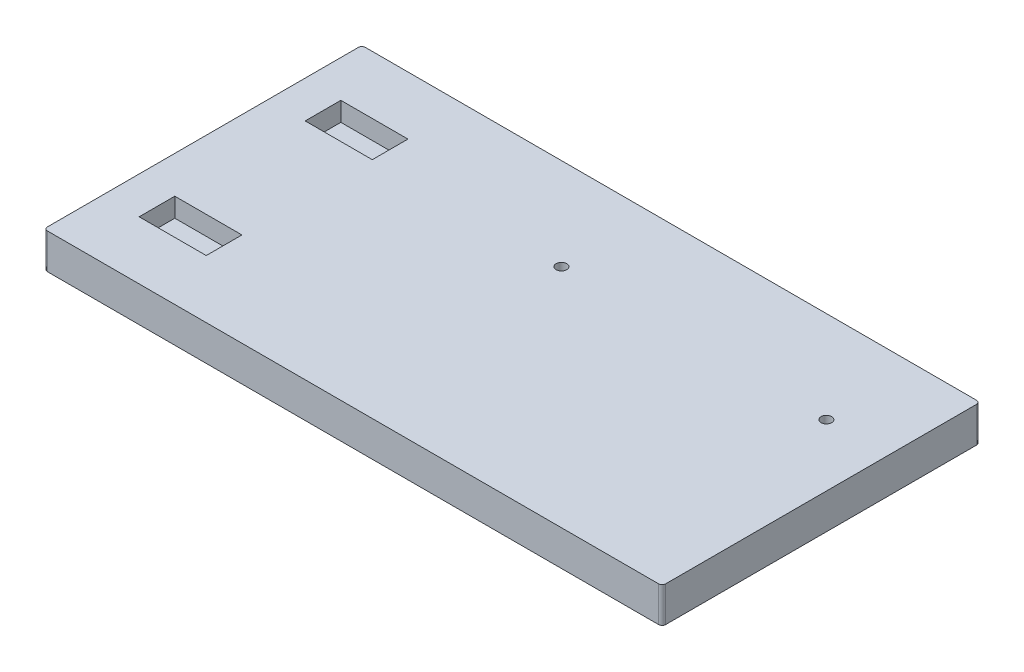
ISO-10303-21;
HEADER;
FILE_DESCRIPTION(('STEP AP214'),'2;1');
FILE_NAME('part.step','',(''),(''),'','','');
FILE_SCHEMA(('AUTOMOTIVE_DESIGN { 1 0 10303 214 1 1 1 1 }'));
ENDSEC;
DATA;
#1=APPLICATION_CONTEXT('core data for automotive mechanical design processes');
#2=APPLICATION_PROTOCOL_DEFINITION('international standard','automotive_design',2000,#1);
#3=PRODUCT_CONTEXT('',#1,'mechanical');
#4=PRODUCT('Part','Part','',(#3));
#5=PRODUCT_RELATED_PRODUCT_CATEGORY('part','',(#4));
#6=PRODUCT_DEFINITION_FORMATION('','',#4);
#7=PRODUCT_DEFINITION_CONTEXT('part definition',#1,'design');
#8=PRODUCT_DEFINITION('design','',#6,#7);
#9=PRODUCT_DEFINITION_SHAPE('','',#8);
#10=(LENGTH_UNIT() NAMED_UNIT(*) SI_UNIT(.MILLI.,.METRE.));
#11=(NAMED_UNIT(*) PLANE_ANGLE_UNIT() SI_UNIT($,.RADIAN.));
#12=(NAMED_UNIT(*) SI_UNIT($,.STERADIAN.) SOLID_ANGLE_UNIT());
#13=UNCERTAINTY_MEASURE_WITH_UNIT(LENGTH_MEASURE(1.E-05),#10,'distance_accuracy_value','');
#14=(GEOMETRIC_REPRESENTATION_CONTEXT(3) GLOBAL_UNCERTAINTY_ASSIGNED_CONTEXT((#13)) GLOBAL_UNIT_ASSIGNED_CONTEXT((#10,
#11,#12)) REPRESENTATION_CONTEXT('',''));
#15=CARTESIAN_POINT('',(0.,0.,0.));
#16=DIRECTION('',(0.,0.,1.));
#17=DIRECTION('',(1.,0.,0.));
#18=AXIS2_PLACEMENT_3D('',#15,#16,#17);
#19=CARTESIAN_POINT('',(0.,10.,0.));
#20=DIRECTION('',(0.,1.,0.));
#21=DIRECTION('',(0.,0.,1.));
#22=AXIS2_PLACEMENT_3D('',#19,#20,#21);
#23=PLANE('',#22);
#24=CARTESIAN_POINT('',(-4.99999999999998,10.,-19.));
#25=DIRECTION('',(0.,1.,0.));
#26=DIRECTION('',(0.,0.,1.));
#27=AXIS2_PLACEMENT_3D('',#24,#25,#26);
#28=CIRCLE('',#27,1.5);
#29=CARTESIAN_POINT('',(-4.99999999999998,10.,-17.5));
#30=VERTEX_POINT('',#29);
#31=EDGE_CURVE('E531',#30,#30,#28,.T.);
#32=ORIENTED_EDGE('',*,*,#31,.F.);
#33=EDGE_LOOP('',(#32));
#34=FACE_BOUND('',#33,.T.);
#35=CARTESIAN_POINT('',(70.,10.,-19.));
#36=DIRECTION('',(0.,1.,0.));
#37=DIRECTION('',(0.,0.,1.));
#38=AXIS2_PLACEMENT_3D('',#35,#36,#37);
#39=CIRCLE('',#38,1.5);
#40=CARTESIAN_POINT('',(70.,10.,-17.5));
#41=VERTEX_POINT('',#40);
#42=EDGE_CURVE('E530',#41,#41,#39,.T.);
#43=ORIENTED_EDGE('',*,*,#42,.F.);
#44=EDGE_LOOP('',(#43));
#45=FACE_BOUND('',#44,.T.);
#46=DIRECTION('',(1.,0.,0.));
#47=VECTOR('',#46,1.);
#48=CARTESIAN_POINT('',(0.,10.,28.55));
#49=LINE('',#48,#47);
#50=CARTESIAN_POINT('',(-77.,10.,28.55));
#51=VERTEX_POINT('',#50);
#52=CARTESIAN_POINT('',(-58.,10.,28.55));
#53=VERTEX_POINT('',#52);
#54=EDGE_CURVE('E198',#51,#53,#49,.T.);
#55=ORIENTED_EDGE('',*,*,#54,.F.);
#56=DIRECTION('',(0.,0.,-1.));
#57=VECTOR('',#56,1.);
#58=CARTESIAN_POINT('',(-77.,10.,0.));
#59=LINE('',#58,#57);
#60=CARTESIAN_POINT('',(-77.,10.,18.45));
#61=VERTEX_POINT('',#60);
#62=EDGE_CURVE('E206',#51,#61,#59,.T.);
#63=ORIENTED_EDGE('',*,*,#62,.T.);
#64=DIRECTION('',(1.,0.,0.));
#65=VECTOR('',#64,1.);
#66=CARTESIAN_POINT('',(0.,10.,18.45));
#67=LINE('',#66,#65);
#68=CARTESIAN_POINT('',(-58.,10.,18.45));
#69=VERTEX_POINT('',#68);
#70=EDGE_CURVE('E218',#61,#69,#67,.T.);
#71=ORIENTED_EDGE('',*,*,#70,.T.);
#72=DIRECTION('',(0.,0.,-1.));
#73=VECTOR('',#72,1.);
#74=CARTESIAN_POINT('',(-58.,10.,0.));
#75=LINE('',#74,#73);
#76=EDGE_CURVE('E215',#53,#69,#75,.T.);
#77=ORIENTED_EDGE('',*,*,#76,.F.);
#78=EDGE_LOOP('',(#55,#63,#71,#77));
#79=FACE_BOUND('',#78,.T.);
#80=DIRECTION('',(-1.,0.,0.));
#81=VECTOR('',#80,1.);
#82=CARTESIAN_POINT('',(87.5,10.,-45.));
#83=LINE('',#82,#81);
#84=CARTESIAN_POINT('',(86.5,10.,-45.));
#85=VERTEX_POINT('',#84);
#86=CARTESIAN_POINT('',(-86.5,10.,-45.));
#87=VERTEX_POINT('',#86);
#88=EDGE_CURVE('E240',#85,#87,#83,.T.);
#89=ORIENTED_EDGE('',*,*,#88,.T.);
#90=CARTESIAN_POINT('',(-86.5,10.,-44.));
#91=DIRECTION('',(0.,1.,0.));
#92=DIRECTION('',(0.,0.,1.));
#93=AXIS2_PLACEMENT_3D('',#90,#91,#92);
#94=CIRCLE('',#93,1.);
#95=CARTESIAN_POINT('',(-87.5,10.,-44.));
#96=VERTEX_POINT('',#95);
#97=EDGE_CURVE('E275',#87,#96,#94,.T.);
#98=ORIENTED_EDGE('',*,*,#97,.T.);
#99=DIRECTION('',(0.,0.,1.));
#100=VECTOR('',#99,1.);
#101=CARTESIAN_POINT('',(-87.5,10.,45.));
#102=LINE('',#101,#100);
#103=CARTESIAN_POINT('',(-87.5,10.,44.));
#104=VERTEX_POINT('',#103);
#105=EDGE_CURVE('E232',#96,#104,#102,.T.);
#106=ORIENTED_EDGE('',*,*,#105,.T.);
#107=CARTESIAN_POINT('',(-86.5,10.,44.));
#108=DIRECTION('',(0.,1.,0.));
#109=DIRECTION('',(0.,0.,1.));
#110=AXIS2_PLACEMENT_3D('',#107,#108,#109);
#111=CIRCLE('',#110,1.);
#112=CARTESIAN_POINT('',(-86.5,10.,45.));
#113=VERTEX_POINT('',#112);
#114=EDGE_CURVE('E270',#104,#113,#111,.T.);
#115=ORIENTED_EDGE('',*,*,#114,.T.);
#116=DIRECTION('',(1.,0.,0.));
#117=VECTOR('',#116,1.);
#118=CARTESIAN_POINT('',(87.5,10.,45.));
#119=LINE('',#118,#117);
#120=CARTESIAN_POINT('',(86.5,10.,45.));
#121=VERTEX_POINT('',#120);
#122=EDGE_CURVE('E235',#113,#121,#119,.T.);
#123=ORIENTED_EDGE('',*,*,#122,.T.);
#124=CARTESIAN_POINT('',(86.5,10.,44.));
#125=DIRECTION('',(0.,1.,0.));
#126=DIRECTION('',(0.,0.,1.));
#127=AXIS2_PLACEMENT_3D('',#124,#125,#126);
#128=CIRCLE('',#127,1.);
#129=CARTESIAN_POINT('',(87.5,10.,44.));
#130=VERTEX_POINT('',#129);
#131=EDGE_CURVE('E65',#121,#130,#128,.T.);
#132=ORIENTED_EDGE('',*,*,#131,.T.);
#133=DIRECTION('',(0.,0.,-1.));
#134=VECTOR('',#133,1.);
#135=CARTESIAN_POINT('',(87.5,10.,45.));
#136=LINE('',#135,#134);
#137=CARTESIAN_POINT('',(87.5,10.,-44.));
#138=VERTEX_POINT('',#137);
#139=EDGE_CURVE('E238',#130,#138,#136,.T.);
#140=ORIENTED_EDGE('',*,*,#139,.T.);
#141=CARTESIAN_POINT('',(86.5,10.,-44.));
#142=DIRECTION('',(0.,1.,0.));
#143=DIRECTION('',(0.,0.,1.));
#144=AXIS2_PLACEMENT_3D('',#141,#142,#143);
#145=CIRCLE('',#144,1.);
#146=EDGE_CURVE('E273',#138,#85,#145,.T.);
#147=ORIENTED_EDGE('',*,*,#146,.T.);
#148=EDGE_LOOP('',(#89,#98,#106,#115,#123,#132,#140,#147));
#149=FACE_BOUND('',#148,.T.);
#150=DIRECTION('',(0.,0.,1.));
#151=VECTOR('',#150,1.);
#152=CARTESIAN_POINT('',(-77.,10.,0.));
#153=LINE('',#152,#151);
#154=CARTESIAN_POINT('',(-77.,10.,-28.55));
#155=VERTEX_POINT('',#154);
#156=CARTESIAN_POINT('',(-77.,10.,-18.45));
#157=VERTEX_POINT('',#156);
#158=EDGE_CURVE('E188',#155,#157,#153,.T.);
#159=ORIENTED_EDGE('',*,*,#158,.F.);
#160=DIRECTION('',(1.,0.,0.));
#161=VECTOR('',#160,1.);
#162=CARTESIAN_POINT('',(0.,10.,-28.55));
#163=LINE('',#162,#161);
#164=CARTESIAN_POINT('',(-58.,10.,-28.55));
#165=VERTEX_POINT('',#164);
#166=EDGE_CURVE('E164',#155,#165,#163,.T.);
#167=ORIENTED_EDGE('',*,*,#166,.T.);
#168=DIRECTION('',(0.,0.,1.));
#169=VECTOR('',#168,1.);
#170=CARTESIAN_POINT('',(-58.,10.,0.));
#171=LINE('',#170,#169);
#172=CARTESIAN_POINT('',(-58.,10.,-18.45));
#173=VERTEX_POINT('',#172);
#174=EDGE_CURVE('E177',#165,#173,#171,.T.);
#175=ORIENTED_EDGE('',*,*,#174,.T.);
#176=DIRECTION('',(1.,0.,0.));
#177=VECTOR('',#176,1.);
#178=CARTESIAN_POINT('',(0.,10.,-18.45));
#179=LINE('',#178,#177);
#180=EDGE_CURVE('E191',#157,#173,#179,.T.);
#181=ORIENTED_EDGE('',*,*,#180,.F.);
#182=EDGE_LOOP('',(#159,#167,#175,#181));
#183=FACE_BOUND('',#182,.T.);
#184=ADVANCED_FACE('F43',(#34,#45,#79,#149,#183),#23,.T.);
#185=CARTESIAN_POINT('',(-87.5,10.,45.));
#186=DIRECTION('',(1.,0.,0.));
#187=DIRECTION('',(0.,0.,-1.));
#188=AXIS2_PLACEMENT_3D('',#185,#186,#187);
#189=PLANE('',#188);
#190=ORIENTED_EDGE('',*,*,#105,.F.);
#191=DIRECTION('',(0.,-1.,0.));
#192=VECTOR('',#191,1.);
#193=CARTESIAN_POINT('',(-87.5,10.,-44.));
#194=LINE('',#193,#192);
#195=CARTESIAN_POINT('',(-87.5,0.,-44.));
#196=VERTEX_POINT('',#195);
#197=EDGE_CURVE('E254',#96,#196,#194,.T.);
#198=ORIENTED_EDGE('',*,*,#197,.T.);
#199=DIRECTION('',(0.,0.,1.));
#200=VECTOR('',#199,1.);
#201=CARTESIAN_POINT('',(-87.5,0.,45.));
#202=LINE('',#201,#200);
#203=CARTESIAN_POINT('',(-87.5,0.,44.));
#204=VERTEX_POINT('',#203);
#205=EDGE_CURVE('E225',#196,#204,#202,.T.);
#206=ORIENTED_EDGE('',*,*,#205,.T.);
#207=DIRECTION('',(0.,-1.,0.));
#208=VECTOR('',#207,1.);
#209=CARTESIAN_POINT('',(-87.5,10.,44.));
#210=LINE('',#209,#208);
#211=EDGE_CURVE('E243',#204,#104,#210,.F.);
#212=ORIENTED_EDGE('',*,*,#211,.T.);
#213=EDGE_LOOP('',(#190,#198,#206,#212));
#214=FACE_BOUND('',#213,.T.);
#215=ADVANCED_FACE('F313',(#214),#189,.F.);
#216=CARTESIAN_POINT('',(87.5,10.,45.));
#217=DIRECTION('',(0.,0.,-1.));
#218=DIRECTION('',(-1.,0.,0.));
#219=AXIS2_PLACEMENT_3D('',#216,#217,#218);
#220=PLANE('',#219);
#221=DIRECTION('',(1.,0.,0.));
#222=VECTOR('',#221,1.);
#223=CARTESIAN_POINT('',(87.5,0.,45.));
#224=LINE('',#223,#222);
#225=CARTESIAN_POINT('',(-86.5,0.,45.));
#226=VERTEX_POINT('',#225);
#227=CARTESIAN_POINT('',(86.5,0.,45.));
#228=VERTEX_POINT('',#227);
#229=EDGE_CURVE('E246',#226,#228,#224,.T.);
#230=ORIENTED_EDGE('',*,*,#229,.T.);
#231=DIRECTION('',(0.,-1.,0.));
#232=VECTOR('',#231,1.);
#233=CARTESIAN_POINT('',(86.5,10.,45.));
#234=LINE('',#233,#232);
#235=EDGE_CURVE('E11',#228,#121,#234,.F.);
#236=ORIENTED_EDGE('',*,*,#235,.T.);
#237=ORIENTED_EDGE('',*,*,#122,.F.);
#238=DIRECTION('',(0.,-1.,0.));
#239=VECTOR('',#238,1.);
#240=CARTESIAN_POINT('',(-86.5,10.,45.));
#241=LINE('',#240,#239);
#242=EDGE_CURVE('E51',#113,#226,#241,.T.);
#243=ORIENTED_EDGE('',*,*,#242,.T.);
#244=EDGE_LOOP('',(#230,#236,#237,#243));
#245=FACE_BOUND('',#244,.T.);
#246=ADVANCED_FACE('F285',(#245),#220,.F.);
#247=CARTESIAN_POINT('',(87.5,10.,45.));
#248=DIRECTION('',(-1.,0.,0.));
#249=DIRECTION('',(0.,0.,1.));
#250=AXIS2_PLACEMENT_3D('',#247,#248,#249);
#251=PLANE('',#250);
#252=DIRECTION('',(0.,0.,-1.));
#253=VECTOR('',#252,1.);
#254=CARTESIAN_POINT('',(87.5,0.,45.));
#255=LINE('',#254,#253);
#256=CARTESIAN_POINT('',(87.5,0.,44.));
#257=VERTEX_POINT('',#256);
#258=CARTESIAN_POINT('',(87.5,0.,-44.));
#259=VERTEX_POINT('',#258);
#260=EDGE_CURVE('E249',#257,#259,#255,.T.);
#261=ORIENTED_EDGE('',*,*,#260,.T.);
#262=DIRECTION('',(0.,-1.,0.));
#263=VECTOR('',#262,1.);
#264=CARTESIAN_POINT('',(87.5,10.,-44.));
#265=LINE('',#264,#263);
#266=EDGE_CURVE('E58',#259,#138,#265,.F.);
#267=ORIENTED_EDGE('',*,*,#266,.T.);
#268=ORIENTED_EDGE('',*,*,#139,.F.);
#269=DIRECTION('',(0.,-1.,0.));
#270=VECTOR('',#269,1.);
#271=CARTESIAN_POINT('',(87.5,10.,44.));
#272=LINE('',#271,#270);
#273=EDGE_CURVE('E277',#130,#257,#272,.T.);
#274=ORIENTED_EDGE('',*,*,#273,.T.);
#275=EDGE_LOOP('',(#261,#267,#268,#274));
#276=FACE_BOUND('',#275,.T.);
#277=ADVANCED_FACE('F296',(#276),#251,.F.);
#278=CARTESIAN_POINT('',(87.5,10.,-45.));
#279=DIRECTION('',(0.,0.,1.));
#280=DIRECTION('',(1.,0.,0.));
#281=AXIS2_PLACEMENT_3D('',#278,#279,#280);
#282=PLANE('',#281);
#283=DIRECTION('',(-1.,0.,0.));
#284=VECTOR('',#283,1.);
#285=CARTESIAN_POINT('',(87.5,0.,-45.));
#286=LINE('',#285,#284);
#287=CARTESIAN_POINT('',(86.5,0.,-45.));
#288=VERTEX_POINT('',#287);
#289=CARTESIAN_POINT('',(-86.5,0.,-45.));
#290=VERTEX_POINT('',#289);
#291=EDGE_CURVE('E236',#288,#290,#286,.T.);
#292=ORIENTED_EDGE('',*,*,#291,.T.);
#293=DIRECTION('',(0.,-1.,0.));
#294=VECTOR('',#293,1.);
#295=CARTESIAN_POINT('',(-86.5,10.,-45.));
#296=LINE('',#295,#294);
#297=EDGE_CURVE('E268',#290,#87,#296,.F.);
#298=ORIENTED_EDGE('',*,*,#297,.T.);
#299=ORIENTED_EDGE('',*,*,#88,.F.);
#300=DIRECTION('',(0.,-1.,0.));
#301=VECTOR('',#300,1.);
#302=CARTESIAN_POINT('',(86.5,10.,-45.));
#303=LINE('',#302,#301);
#304=EDGE_CURVE('E265',#85,#288,#303,.T.);
#305=ORIENTED_EDGE('',*,*,#304,.T.);
#306=EDGE_LOOP('',(#292,#298,#299,#305));
#307=FACE_BOUND('',#306,.T.);
#308=ADVANCED_FACE('F305',(#307),#282,.F.);
#309=CARTESIAN_POINT('',(0.,0.,0.));
#310=DIRECTION('',(0.,1.,0.));
#311=DIRECTION('',(0.,0.,1.));
#312=AXIS2_PLACEMENT_3D('',#309,#310,#311);
#313=PLANE('',#312);
#314=CARTESIAN_POINT('',(-4.99999999999998,0.,-19.));
#315=DIRECTION('',(0.,1.,0.));
#316=DIRECTION('',(0.,0.,1.));
#317=AXIS2_PLACEMENT_3D('',#314,#315,#316);
#318=CIRCLE('',#317,1.5);
#319=CARTESIAN_POINT('',(-4.99999999999998,0.,-17.5));
#320=VERTEX_POINT('',#319);
#321=EDGE_CURVE('E189',#320,#320,#318,.T.);
#322=ORIENTED_EDGE('',*,*,#321,.T.);
#323=EDGE_LOOP('',(#322));
#324=FACE_BOUND('',#323,.T.);
#325=CARTESIAN_POINT('',(70.,0.,-19.));
#326=DIRECTION('',(0.,1.,0.));
#327=DIRECTION('',(0.,0.,1.));
#328=AXIS2_PLACEMENT_3D('',#325,#326,#327);
#329=CIRCLE('',#328,1.5);
#330=CARTESIAN_POINT('',(70.,0.,-17.5));
#331=VERTEX_POINT('',#330);
#332=EDGE_CURVE('E527',#331,#331,#329,.T.);
#333=ORIENTED_EDGE('',*,*,#332,.T.);
#334=EDGE_LOOP('',(#333));
#335=FACE_BOUND('',#334,.T.);
#336=ORIENTED_EDGE('',*,*,#205,.F.);
#337=CARTESIAN_POINT('',(-86.5,0.,-44.));
#338=DIRECTION('',(0.,1.,0.));
#339=DIRECTION('',(0.,0.,1.));
#340=AXIS2_PLACEMENT_3D('',#337,#338,#339);
#341=CIRCLE('',#340,1.);
#342=EDGE_CURVE('E263',#196,#290,#341,.F.);
#343=ORIENTED_EDGE('',*,*,#342,.T.);
#344=ORIENTED_EDGE('',*,*,#291,.F.);
#345=CARTESIAN_POINT('',(86.5,0.,-44.));
#346=DIRECTION('',(0.,1.,0.));
#347=DIRECTION('',(0.,0.,1.));
#348=AXIS2_PLACEMENT_3D('',#345,#346,#347);
#349=CIRCLE('',#348,1.);
#350=EDGE_CURVE('E261',#288,#259,#349,.F.);
#351=ORIENTED_EDGE('',*,*,#350,.T.);
#352=ORIENTED_EDGE('',*,*,#260,.F.);
#353=CARTESIAN_POINT('',(86.5,0.,44.));
#354=DIRECTION('',(0.,1.,0.));
#355=DIRECTION('',(0.,0.,1.));
#356=AXIS2_PLACEMENT_3D('',#353,#354,#355);
#357=CIRCLE('',#356,1.);
#358=EDGE_CURVE('E259',#257,#228,#357,.F.);
#359=ORIENTED_EDGE('',*,*,#358,.T.);
#360=ORIENTED_EDGE('',*,*,#229,.F.);
#361=CARTESIAN_POINT('',(-86.5,0.,44.));
#362=DIRECTION('',(0.,1.,0.));
#363=DIRECTION('',(0.,0.,1.));
#364=AXIS2_PLACEMENT_3D('',#361,#362,#363);
#365=CIRCLE('',#364,1.);
#366=EDGE_CURVE('E257',#226,#204,#365,.F.);
#367=ORIENTED_EDGE('',*,*,#366,.T.);
#368=EDGE_LOOP('',(#336,#343,#344,#351,#352,#359,#360,#367));
#369=FACE_BOUND('',#368,.T.);
#370=ADVANCED_FACE('F291',(#324,#335,#369),#313,.F.);
#371=CARTESIAN_POINT('',(0.,4.6,28.55));
#372=DIRECTION('',(0.,0.,1.));
#373=DIRECTION('',(1.,0.,0.));
#374=AXIS2_PLACEMENT_3D('',#371,#372,#373);
#375=PLANE('',#374);
#376=ORIENTED_EDGE('',*,*,#54,.T.);
#377=DIRECTION('',(0.,1.,0.));
#378=VECTOR('',#377,1.);
#379=CARTESIAN_POINT('',(-58.,4.6,28.55));
#380=LINE('',#379,#378);
#381=CARTESIAN_POINT('',(-58.,4.6,28.55));
#382=VERTEX_POINT('',#381);
#383=EDGE_CURVE('E213',#382,#53,#380,.T.);
#384=ORIENTED_EDGE('',*,*,#383,.F.);
#385=DIRECTION('',(1.,0.,0.));
#386=VECTOR('',#385,1.);
#387=CARTESIAN_POINT('',(0.,4.6,28.55));
#388=LINE('',#387,#386);
#389=CARTESIAN_POINT('',(-77.,4.6,28.55));
#390=VERTEX_POINT('',#389);
#391=EDGE_CURVE('E202',#390,#382,#388,.T.);
#392=ORIENTED_EDGE('',*,*,#391,.F.);
#393=DIRECTION('',(0.,1.,0.));
#394=VECTOR('',#393,1.);
#395=CARTESIAN_POINT('',(-77.,4.6,28.55));
#396=LINE('',#395,#394);
#397=EDGE_CURVE('E223',#390,#51,#396,.T.);
#398=ORIENTED_EDGE('',*,*,#397,.T.);
#399=EDGE_LOOP('',(#376,#384,#392,#398));
#400=FACE_BOUND('',#399,.T.);
#401=ADVANCED_FACE('F331',(#400),#375,.F.);
#402=CARTESIAN_POINT('',(-77.,4.6,0.));
#403=DIRECTION('',(1.,0.,0.));
#404=DIRECTION('',(0.,0.,-1.));
#405=AXIS2_PLACEMENT_3D('',#402,#403,#404);
#406=PLANE('',#405);
#407=ORIENTED_EDGE('',*,*,#62,.F.);
#408=ORIENTED_EDGE('',*,*,#397,.F.);
#409=DIRECTION('',(0.,0.,-1.));
#410=VECTOR('',#409,1.);
#411=CARTESIAN_POINT('',(-77.,4.6,0.));
#412=LINE('',#411,#410);
#413=CARTESIAN_POINT('',(-77.,4.6,18.45));
#414=VERTEX_POINT('',#413);
#415=EDGE_CURVE('E211',#390,#414,#412,.T.);
#416=ORIENTED_EDGE('',*,*,#415,.T.);
#417=DIRECTION('',(0.,1.,0.));
#418=VECTOR('',#417,1.);
#419=CARTESIAN_POINT('',(-77.,4.6,18.45));
#420=LINE('',#419,#418);
#421=EDGE_CURVE('E226',#414,#61,#420,.T.);
#422=ORIENTED_EDGE('',*,*,#421,.T.);
#423=EDGE_LOOP('',(#407,#408,#416,#422));
#424=FACE_BOUND('',#423,.T.);
#425=ADVANCED_FACE('F450',(#424),#406,.T.);
#426=CARTESIAN_POINT('',(0.,4.6,18.45));
#427=DIRECTION('',(0.,0.,1.));
#428=DIRECTION('',(1.,0.,0.));
#429=AXIS2_PLACEMENT_3D('',#426,#427,#428);
#430=PLANE('',#429);
#431=ORIENTED_EDGE('',*,*,#70,.F.);
#432=ORIENTED_EDGE('',*,*,#421,.F.);
#433=DIRECTION('',(1.,0.,0.));
#434=VECTOR('',#433,1.);
#435=CARTESIAN_POINT('',(0.,4.6,18.45));
#436=LINE('',#435,#434);
#437=CARTESIAN_POINT('',(-58.,4.6,18.45));
#438=VERTEX_POINT('',#437);
#439=EDGE_CURVE('E209',#414,#438,#436,.T.);
#440=ORIENTED_EDGE('',*,*,#439,.T.);
#441=DIRECTION('',(0.,1.,0.));
#442=VECTOR('',#441,1.);
#443=CARTESIAN_POINT('',(-58.,4.6,18.45));
#444=LINE('',#443,#442);
#445=EDGE_CURVE('E228',#438,#69,#444,.T.);
#446=ORIENTED_EDGE('',*,*,#445,.T.);
#447=EDGE_LOOP('',(#431,#432,#440,#446));
#448=FACE_BOUND('',#447,.T.);
#449=ADVANCED_FACE('F442',(#448),#430,.T.);
#450=CARTESIAN_POINT('',(-58.,4.6,0.));
#451=DIRECTION('',(1.,0.,0.));
#452=DIRECTION('',(0.,0.,-1.));
#453=AXIS2_PLACEMENT_3D('',#450,#451,#452);
#454=PLANE('',#453);
#455=ORIENTED_EDGE('',*,*,#76,.T.);
#456=ORIENTED_EDGE('',*,*,#445,.F.);
#457=DIRECTION('',(0.,0.,-1.));
#458=VECTOR('',#457,1.);
#459=CARTESIAN_POINT('',(-58.,4.6,0.));
#460=LINE('',#459,#458);
#461=EDGE_CURVE('E205',#382,#438,#460,.T.);
#462=ORIENTED_EDGE('',*,*,#461,.F.);
#463=ORIENTED_EDGE('',*,*,#383,.T.);
#464=EDGE_LOOP('',(#455,#456,#462,#463));
#465=FACE_BOUND('',#464,.T.);
#466=ADVANCED_FACE('F433',(#465),#454,.F.);
#467=CARTESIAN_POINT('',(0.,4.6,0.));
#468=DIRECTION('',(0.,1.,0.));
#469=DIRECTION('',(0.,0.,1.));
#470=AXIS2_PLACEMENT_3D('',#467,#468,#469);
#471=PLANE('',#470);
#472=ORIENTED_EDGE('',*,*,#391,.T.);
#473=ORIENTED_EDGE('',*,*,#461,.T.);
#474=ORIENTED_EDGE('',*,*,#439,.F.);
#475=ORIENTED_EDGE('',*,*,#415,.F.);
#476=EDGE_LOOP('',(#472,#473,#474,#475));
#477=FACE_BOUND('',#476,.T.);
#478=ADVANCED_FACE('F420',(#477),#471,.T.);
#479=CARTESIAN_POINT('',(0.,4.6,-28.55));
#480=DIRECTION('',(0.,0.,1.));
#481=DIRECTION('',(1.,0.,0.));
#482=AXIS2_PLACEMENT_3D('',#479,#480,#481);
#483=PLANE('',#482);
#484=ORIENTED_EDGE('',*,*,#166,.F.);
#485=DIRECTION('',(0.,1.,0.));
#486=VECTOR('',#485,1.);
#487=CARTESIAN_POINT('',(-77.,4.6,-28.55));
#488=LINE('',#487,#486);
#489=CARTESIAN_POINT('',(-77.,4.6,-28.55));
#490=VERTEX_POINT('',#489);
#491=EDGE_CURVE('E157',#490,#155,#488,.T.);
#492=ORIENTED_EDGE('',*,*,#491,.F.);
#493=DIRECTION('',(1.,0.,0.));
#494=VECTOR('',#493,1.);
#495=CARTESIAN_POINT('',(0.,4.6,-28.55));
#496=LINE('',#495,#494);
#497=CARTESIAN_POINT('',(-58.,4.6,-28.55));
#498=VERTEX_POINT('',#497);
#499=EDGE_CURVE('E161',#490,#498,#496,.T.);
#500=ORIENTED_EDGE('',*,*,#499,.T.);
#501=DIRECTION('',(0.,1.,0.));
#502=VECTOR('',#501,1.);
#503=CARTESIAN_POINT('',(-58.,4.6,-28.55));
#504=LINE('',#503,#502);
#505=EDGE_CURVE('E196',#498,#165,#504,.T.);
#506=ORIENTED_EDGE('',*,*,#505,.T.);
#507=EDGE_LOOP('',(#484,#492,#500,#506));
#508=FACE_BOUND('',#507,.T.);
#509=ADVANCED_FACE('F159',(#508),#483,.T.);
#510=CARTESIAN_POINT('',(-58.,4.6,0.));
#511=DIRECTION('',(-1.,0.,0.));
#512=DIRECTION('',(0.,0.,1.));
#513=AXIS2_PLACEMENT_3D('',#510,#511,#512);
#514=PLANE('',#513);
#515=ORIENTED_EDGE('',*,*,#174,.F.);
#516=ORIENTED_EDGE('',*,*,#505,.F.);
#517=DIRECTION('',(0.,0.,1.));
#518=VECTOR('',#517,1.);
#519=CARTESIAN_POINT('',(-58.,4.6,0.));
#520=LINE('',#519,#518);
#521=CARTESIAN_POINT('',(-58.,4.6,-18.45));
#522=VERTEX_POINT('',#521);
#523=EDGE_CURVE('E170',#498,#522,#520,.T.);
#524=ORIENTED_EDGE('',*,*,#523,.T.);
#525=DIRECTION('',(0.,1.,0.));
#526=VECTOR('',#525,1.);
#527=CARTESIAN_POINT('',(-58.,4.6,-18.45));
#528=LINE('',#527,#526);
#529=EDGE_CURVE('E199',#522,#173,#528,.T.);
#530=ORIENTED_EDGE('',*,*,#529,.T.);
#531=EDGE_LOOP('',(#515,#516,#524,#530));
#532=FACE_BOUND('',#531,.T.);
#533=ADVANCED_FACE('F404',(#532),#514,.T.);
#534=CARTESIAN_POINT('',(0.,4.6,-18.45));
#535=DIRECTION('',(0.,0.,1.));
#536=DIRECTION('',(1.,0.,0.));
#537=AXIS2_PLACEMENT_3D('',#534,#535,#536);
#538=PLANE('',#537);
#539=ORIENTED_EDGE('',*,*,#180,.T.);
#540=ORIENTED_EDGE('',*,*,#529,.F.);
#541=DIRECTION('',(1.,0.,0.));
#542=VECTOR('',#541,1.);
#543=CARTESIAN_POINT('',(0.,4.6,-18.45));
#544=LINE('',#543,#542);
#545=CARTESIAN_POINT('',(-77.,4.6,-18.45));
#546=VERTEX_POINT('',#545);
#547=EDGE_CURVE('E181',#546,#522,#544,.T.);
#548=ORIENTED_EDGE('',*,*,#547,.F.);
#549=DIRECTION('',(0.,1.,0.));
#550=VECTOR('',#549,1.);
#551=CARTESIAN_POINT('',(-77.,4.6,-18.45));
#552=LINE('',#551,#550);
#553=EDGE_CURVE('E169',#546,#157,#552,.T.);
#554=ORIENTED_EDGE('',*,*,#553,.T.);
#555=EDGE_LOOP('',(#539,#540,#548,#554));
#556=FACE_BOUND('',#555,.T.);
#557=ADVANCED_FACE('F396',(#556),#538,.F.);
#558=CARTESIAN_POINT('',(-77.,4.6,0.));
#559=DIRECTION('',(-1.,0.,0.));
#560=DIRECTION('',(0.,0.,1.));
#561=AXIS2_PLACEMENT_3D('',#558,#559,#560);
#562=PLANE('',#561);
#563=ORIENTED_EDGE('',*,*,#158,.T.);
#564=ORIENTED_EDGE('',*,*,#553,.F.);
#565=DIRECTION('',(0.,0.,1.));
#566=VECTOR('',#565,1.);
#567=CARTESIAN_POINT('',(-77.,4.6,0.));
#568=LINE('',#567,#566);
#569=EDGE_CURVE('E176',#490,#546,#568,.T.);
#570=ORIENTED_EDGE('',*,*,#569,.F.);
#571=ORIENTED_EDGE('',*,*,#491,.T.);
#572=EDGE_LOOP('',(#563,#564,#570,#571));
#573=FACE_BOUND('',#572,.T.);
#574=ADVANCED_FACE('F179',(#573),#562,.F.);
#575=CARTESIAN_POINT('',(0.,4.6,0.));
#576=DIRECTION('',(0.,1.,0.));
#577=DIRECTION('',(0.,0.,-1.));
#578=AXIS2_PLACEMENT_3D('',#575,#576,#577);
#579=PLANE('',#578);
#580=ORIENTED_EDGE('',*,*,#499,.F.);
#581=ORIENTED_EDGE('',*,*,#569,.T.);
#582=ORIENTED_EDGE('',*,*,#547,.T.);
#583=ORIENTED_EDGE('',*,*,#523,.F.);
#584=EDGE_LOOP('',(#580,#581,#582,#583));
#585=FACE_BOUND('',#584,.T.);
#586=ADVANCED_FACE('F174',(#585),#579,.T.);
#587=CARTESIAN_POINT('',(70.,0.,-19.));
#588=DIRECTION('',(0.,1.,0.));
#589=DIRECTION('',(0.,0.,1.));
#590=AXIS2_PLACEMENT_3D('',#587,#588,#589);
#591=CYLINDRICAL_SURFACE('',#590,1.5);
#592=ORIENTED_EDGE('',*,*,#332,.F.);
#593=EDGE_LOOP('',(#592));
#594=FACE_BOUND('',#593,.T.);
#595=ORIENTED_EDGE('',*,*,#42,.T.);
#596=EDGE_LOOP('',(#595));
#597=FACE_BOUND('',#596,.T.);
#598=ADVANCED_FACE('F372',(#594,#597),#591,.F.);
#599=CARTESIAN_POINT('',(-4.99999999999998,0.,-19.));
#600=DIRECTION('',(0.,1.,0.));
#601=DIRECTION('',(0.,0.,1.));
#602=AXIS2_PLACEMENT_3D('',#599,#600,#601);
#603=CYLINDRICAL_SURFACE('',#602,1.5);
#604=ORIENTED_EDGE('',*,*,#321,.F.);
#605=EDGE_LOOP('',(#604));
#606=FACE_BOUND('',#605,.T.);
#607=ORIENTED_EDGE('',*,*,#31,.T.);
#608=EDGE_LOOP('',(#607));
#609=FACE_BOUND('',#608,.T.);
#610=ADVANCED_FACE('F344',(#606,#609),#603,.F.);
#611=CARTESIAN_POINT('',(-86.5,10.,-44.));
#612=DIRECTION('',(0.,-1.,0.));
#613=DIRECTION('',(0.,0.,-1.));
#614=AXIS2_PLACEMENT_3D('',#611,#612,#613);
#615=CYLINDRICAL_SURFACE('',#614,1.);
#616=ORIENTED_EDGE('',*,*,#97,.F.);
#617=ORIENTED_EDGE('',*,*,#297,.F.);
#618=ORIENTED_EDGE('',*,*,#342,.F.);
#619=ORIENTED_EDGE('',*,*,#197,.F.);
#620=EDGE_LOOP('',(#616,#617,#618,#619));
#621=FACE_BOUND('',#620,.T.);
#622=ADVANCED_FACE('F310',(#621),#615,.T.);
#623=CARTESIAN_POINT('',(86.5,10.,-44.));
#624=DIRECTION('',(0.,-1.,0.));
#625=DIRECTION('',(0.,0.,-1.));
#626=AXIS2_PLACEMENT_3D('',#623,#624,#625);
#627=CYLINDRICAL_SURFACE('',#626,1.);
#628=ORIENTED_EDGE('',*,*,#146,.F.);
#629=ORIENTED_EDGE('',*,*,#266,.F.);
#630=ORIENTED_EDGE('',*,*,#350,.F.);
#631=ORIENTED_EDGE('',*,*,#304,.F.);
#632=EDGE_LOOP('',(#628,#629,#630,#631));
#633=FACE_BOUND('',#632,.T.);
#634=ADVANCED_FACE('F302',(#633),#627,.T.);
#635=CARTESIAN_POINT('',(86.5,10.,44.));
#636=DIRECTION('',(0.,-1.,0.));
#637=DIRECTION('',(0.,0.,-1.));
#638=AXIS2_PLACEMENT_3D('',#635,#636,#637);
#639=CYLINDRICAL_SURFACE('',#638,1.);
#640=ORIENTED_EDGE('',*,*,#131,.F.);
#641=ORIENTED_EDGE('',*,*,#235,.F.);
#642=ORIENTED_EDGE('',*,*,#358,.F.);
#643=ORIENTED_EDGE('',*,*,#273,.F.);
#644=EDGE_LOOP('',(#640,#641,#642,#643));
#645=FACE_BOUND('',#644,.T.);
#646=ADVANCED_FACE('F295',(#645),#639,.T.);
#647=CARTESIAN_POINT('',(-86.5,10.,44.));
#648=DIRECTION('',(0.,-1.,0.));
#649=DIRECTION('',(0.,0.,-1.));
#650=AXIS2_PLACEMENT_3D('',#647,#648,#649);
#651=CYLINDRICAL_SURFACE('',#650,1.);
#652=ORIENTED_EDGE('',*,*,#114,.F.);
#653=ORIENTED_EDGE('',*,*,#211,.F.);
#654=ORIENTED_EDGE('',*,*,#366,.F.);
#655=ORIENTED_EDGE('',*,*,#242,.F.);
#656=EDGE_LOOP('',(#652,#653,#654,#655));
#657=FACE_BOUND('',#656,.T.);
#658=ADVANCED_FACE('F45',(#657),#651,.T.);
#659=CLOSED_SHELL('',(#184,#215,#246,#277,#308,#370,#401,#425,#449,#466,#478,#509,#533,#557,
#574,#586,#598,#610,#622,#634,#646,#658));
#660=MANIFOLD_SOLID_BREP('B2',#659);
#661=ADVANCED_BREP_SHAPE_REPRESENTATION('',(#18,#660),#14);
#662=SHAPE_DEFINITION_REPRESENTATION(#9,#661);
ENDSEC;
END-ISO-10303-21;
